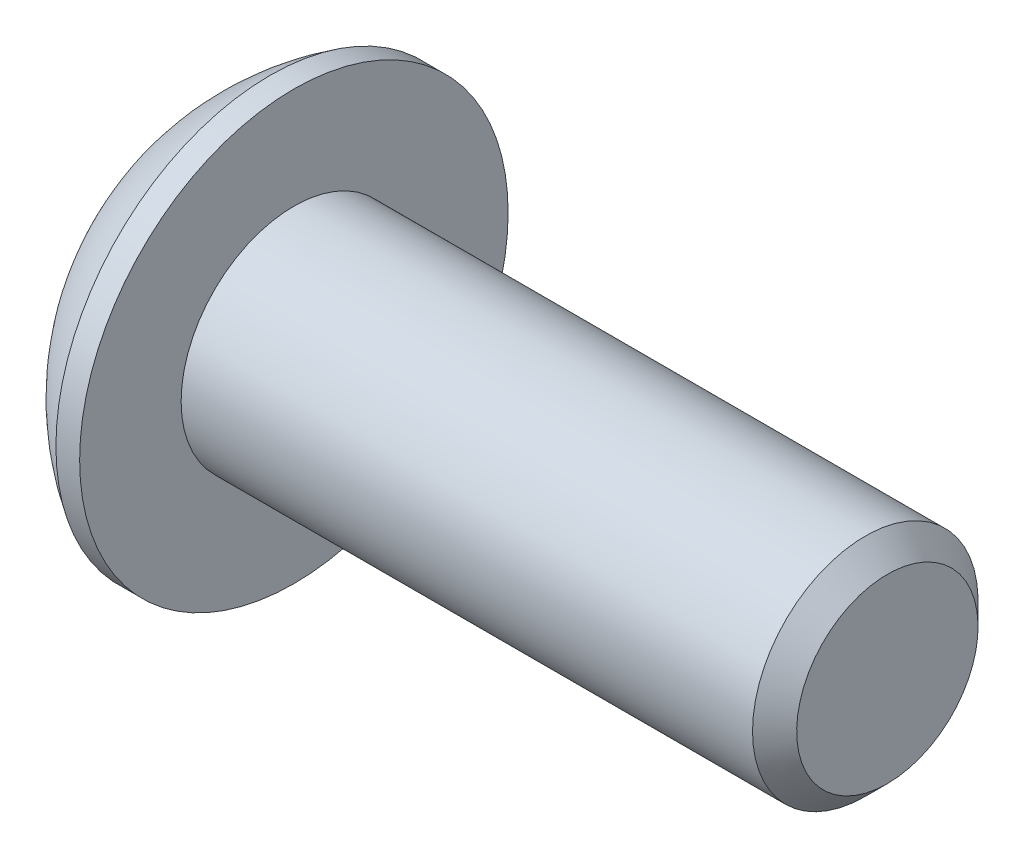
ISO-10303-21;
HEADER;
FILE_DESCRIPTION(('STEP AP214'),'2;1');
FILE_NAME('part.step','',(''),(''),'','','');
FILE_SCHEMA(('AUTOMOTIVE_DESIGN { 1 0 10303 214 1 1 1 1 }'));
ENDSEC;
DATA;
#1=APPLICATION_CONTEXT('core data for automotive mechanical design processes');
#2=APPLICATION_PROTOCOL_DEFINITION('international standard','automotive_design',2000,#1);
#3=PRODUCT_CONTEXT('',#1,'mechanical');
#4=PRODUCT('Part','Part','',(#3));
#5=PRODUCT_RELATED_PRODUCT_CATEGORY('part','',(#4));
#6=PRODUCT_DEFINITION_FORMATION('','',#4);
#7=PRODUCT_DEFINITION_CONTEXT('part definition',#1,'design');
#8=PRODUCT_DEFINITION('design','',#6,#7);
#9=PRODUCT_DEFINITION_SHAPE('','',#8);
#10=(LENGTH_UNIT() NAMED_UNIT(*) SI_UNIT(.MILLI.,.METRE.));
#11=(NAMED_UNIT(*) PLANE_ANGLE_UNIT() SI_UNIT($,.RADIAN.));
#12=(NAMED_UNIT(*) SI_UNIT($,.STERADIAN.) SOLID_ANGLE_UNIT());
#13=UNCERTAINTY_MEASURE_WITH_UNIT(LENGTH_MEASURE(1.E-05),#10,'distance_accuracy_value','');
#14=(GEOMETRIC_REPRESENTATION_CONTEXT(3) GLOBAL_UNCERTAINTY_ASSIGNED_CONTEXT((#13)) GLOBAL_UNIT_ASSIGNED_CONTEXT((#10,
#11,#12)) REPRESENTATION_CONTEXT('',''));
#15=CARTESIAN_POINT('',(0.,0.,0.));
#16=DIRECTION('',(0.,0.,1.));
#17=DIRECTION('',(1.,0.,0.));
#18=AXIS2_PLACEMENT_3D('',#15,#16,#17);
#19=CARTESIAN_POINT('',(1.7779999943448,0.,0.));
#20=DIRECTION('',(-1.,0.,0.));
#21=DIRECTION('',(0.,-1.,0.));
#22=AXIS2_PLACEMENT_3D('',#19,#20,#21);
#23=CONICAL_SURFACE('',#22,1.58749999673491,1.04719755119988);
#24=CARTESIAN_POINT('',(2.69454354479104,0.,-4.44089209850063E-13));
#25=VERTEX_POINT('',#24);
#26=VERTEX_LOOP('',#25);
#27=FACE_BOUND('',#26,.T.);
#28=CARTESIAN_POINT('',(1.77799999434485,0.,0.));
#29=DIRECTION('',(-1.,0.,0.));
#30=DIRECTION('',(0.,-1.,0.));
#31=AXIS2_PLACEMENT_3D('',#28,#29,#30);
#32=CIRCLE('',#31,1.58749999673491);
#33=CARTESIAN_POINT('',(1.77799999717317,0.,1.58749999836612));
#34=VERTEX_POINT('',#33);
#35=CARTESIAN_POINT('',(1.77799999717243,-1.3748153270964,0.793749999181859));
#36=VERTEX_POINT('',#35);
#37=EDGE_CURVE('E20',#34,#36,#32,.F.);
#38=ORIENTED_EDGE('',*,*,#37,.F.);
#39=CARTESIAN_POINT('',(1.77799999434634,0.,0.));
#40=DIRECTION('',(-1.,0.,0.));
#41=DIRECTION('',(0.,-1.,0.));
#42=AXIS2_PLACEMENT_3D('',#39,#40,#41);
#43=CIRCLE('',#42,1.58749999673224);
#44=CARTESIAN_POINT('',(1.77799999717317,1.37481532724848,0.793749998914057));
#45=VERTEX_POINT('',#44);
#46=EDGE_CURVE('E153',#34,#45,#43,.T.);
#47=ORIENTED_EDGE('',*,*,#46,.T.);
#48=CARTESIAN_POINT('',(1.77799999434532,0.,0.));
#49=DIRECTION('',(-1.,0.,0.));
#50=DIRECTION('',(0.,-1.,0.));
#51=AXIS2_PLACEMENT_3D('',#48,#49,#50);
#52=CIRCLE('',#51,1.58749999673402);
#53=CARTESIAN_POINT('',(1.77799999717266,1.37481532693781,-0.793749999455669));
#54=VERTEX_POINT('',#53);
#55=EDGE_CURVE('E462',#45,#54,#52,.T.);
#56=ORIENTED_EDGE('',*,*,#55,.T.);
#57=CARTESIAN_POINT('',(1.7779999943448,0.,0.));
#58=DIRECTION('',(-1.,0.,0.));
#59=DIRECTION('',(0.,-1.,0.));
#60=AXIS2_PLACEMENT_3D('',#57,#58,#59);
#61=CIRCLE('',#60,1.58749999673491);
#62=CARTESIAN_POINT('',(1.7779999971724,0.,-1.58749999836745));
#63=VERTEX_POINT('',#62);
#64=EDGE_CURVE('E463',#54,#63,#61,.T.);
#65=ORIENTED_EDGE('',*,*,#64,.T.);
#66=CARTESIAN_POINT('',(1.77799999434447,0.,0.));
#67=DIRECTION('',(-1.,0.,0.));
#68=DIRECTION('',(0.,-1.,0.));
#69=AXIS2_PLACEMENT_3D('',#66,#67,#68);
#70=CIRCLE('',#69,1.58749999673558);
#71=CARTESIAN_POINT('',(1.77799999717224,-1.37481532709594,-0.793749999181592));
#72=VERTEX_POINT('',#71);
#73=EDGE_CURVE('E466',#72,#63,#70,.F.);
#74=ORIENTED_EDGE('',*,*,#73,.F.);
#75=CARTESIAN_POINT('',(1.77799999434447,0.,0.));
#76=DIRECTION('',(-1.,0.,0.));
#77=DIRECTION('',(0.,-1.,0.));
#78=AXIS2_PLACEMENT_3D('',#75,#76,#77);
#79=CIRCLE('',#78,1.58749999673558);
#80=EDGE_CURVE('E469',#36,#72,#79,.F.);
#81=ORIENTED_EDGE('',*,*,#80,.F.);
#82=EDGE_LOOP('',(#38,#47,#56,#65,#74,#81));
#83=FACE_BOUND('',#82,.T.);
#84=ADVANCED_FACE('F17',(#27,#83),#23,.F.);
#85=CARTESIAN_POINT('',(1.778,-2.74963065702,-1.5875));
#86=DIRECTION('',(1.,0.,0.));
#87=DIRECTION('',(0.,0.,-1.));
#88=AXIS2_PLACEMENT_3D('',#85,#86,#87);
#89=PLANE('',#88);
#90=DIRECTION('',(0.,0.50000000000019,0.866025403784329));
#91=VECTOR('',#90,1.);
#92=CARTESIAN_POINT('',(1.778,-1.83308710468,0.));
#93=LINE('',#92,#91);
#94=CARTESIAN_POINT('',(1.778,-0.916543552272443,1.58750000009422));
#95=VERTEX_POINT('',#94);
#96=EDGE_CURVE('E198',#95,#36,#93,.F.);
#97=ORIENTED_EDGE('',*,*,#96,.F.);
#98=DIRECTION('',(0.,1.,0.));
#99=VECTOR('',#98,1.);
#100=CARTESIAN_POINT('',(1.778,-0.916543552339,1.5875));
#101=LINE('',#100,#99);
#102=EDGE_CURVE('E152',#34,#95,#101,.F.);
#103=ORIENTED_EDGE('',*,*,#102,.F.);
#104=ORIENTED_EDGE('',*,*,#37,.T.);
#105=EDGE_LOOP('',(#97,#103,#104));
#106=FACE_BOUND('',#105,.T.);
#107=ADVANCED_FACE('F277',(#106),#89,.F.);
#108=CARTESIAN_POINT('',(1.778,-2.74963065702,-1.5875));
#109=DIRECTION('',(1.,0.,0.));
#110=DIRECTION('',(0.,0.,-1.));
#111=AXIS2_PLACEMENT_3D('',#108,#109,#110);
#112=PLANE('',#111);
#113=DIRECTION('',(0.,-0.50000000000019,0.866025403784329));
#114=VECTOR('',#113,1.);
#115=CARTESIAN_POINT('',(1.778,-0.916543552339,-1.5875));
#116=LINE('',#115,#114);
#117=CARTESIAN_POINT('',(1.778,-1.83308710474991,1.46216049701282E-10));
#118=VERTEX_POINT('',#117);
#119=EDGE_CURVE('E183',#118,#72,#116,.F.);
#120=ORIENTED_EDGE('',*,*,#119,.F.);
#121=DIRECTION('',(0.,0.50000000000019,0.866025403784329));
#122=VECTOR('',#121,1.);
#123=CARTESIAN_POINT('',(1.778,-1.83308710468,0.));
#124=LINE('',#123,#122);
#125=EDGE_CURVE('E195',#36,#118,#124,.F.);
#126=ORIENTED_EDGE('',*,*,#125,.F.);
#127=ORIENTED_EDGE('',*,*,#80,.T.);
#128=EDGE_LOOP('',(#120,#126,#127));
#129=FACE_BOUND('',#128,.T.);
#130=ADVANCED_FACE('F274',(#129),#112,.F.);
#131=CARTESIAN_POINT('',(1.778,-2.74963065702,-1.5875));
#132=DIRECTION('',(1.,0.,0.));
#133=DIRECTION('',(0.,0.,-1.));
#134=AXIS2_PLACEMENT_3D('',#131,#132,#133);
#135=PLANE('',#134);
#136=DIRECTION('',(0.,1.,0.));
#137=VECTOR('',#136,1.);
#138=CARTESIAN_POINT('',(1.778,0.916543552339,-1.5875));
#139=LINE('',#138,#137);
#140=CARTESIAN_POINT('',(1.778,-0.916543552502021,-1.58749999998871));
#141=VERTEX_POINT('',#140);
#142=EDGE_CURVE('E169',#141,#63,#139,.T.);
#143=ORIENTED_EDGE('',*,*,#142,.F.);
#144=DIRECTION('',(0.,-0.50000000000019,0.866025403784329));
#145=VECTOR('',#144,1.);
#146=CARTESIAN_POINT('',(1.778,-0.916543552339,-1.5875));
#147=LINE('',#146,#145);
#148=EDGE_CURVE('E180',#72,#141,#147,.F.);
#149=ORIENTED_EDGE('',*,*,#148,.F.);
#150=ORIENTED_EDGE('',*,*,#73,.T.);
#151=EDGE_LOOP('',(#143,#149,#150));
#152=FACE_BOUND('',#151,.T.);
#153=ADVANCED_FACE('F270',(#152),#135,.F.);
#154=CARTESIAN_POINT('',(1.778,-2.74963065702,-1.5875));
#155=DIRECTION('',(1.,0.,0.));
#156=DIRECTION('',(0.,0.,-1.));
#157=AXIS2_PLACEMENT_3D('',#154,#155,#156);
#158=PLANE('',#157);
#159=DIRECTION('',(0.,-0.50000000000019,-0.866025403784329));
#160=VECTOR('',#159,1.);
#161=CARTESIAN_POINT('',(1.778,1.83308710468,0.));
#162=LINE('',#161,#160);
#163=CARTESIAN_POINT('',(1.778,0.91654355229244,-1.58750000007156));
#164=VERTEX_POINT('',#163);
#165=EDGE_CURVE('E157',#164,#54,#162,.F.);
#166=ORIENTED_EDGE('',*,*,#165,.F.);
#167=DIRECTION('',(0.,1.,0.));
#168=VECTOR('',#167,1.);
#169=CARTESIAN_POINT('',(1.778,0.916543552339,-1.5875));
#170=LINE('',#169,#168);
#171=EDGE_CURVE('E166',#63,#164,#170,.T.);
#172=ORIENTED_EDGE('',*,*,#171,.F.);
#173=ORIENTED_EDGE('',*,*,#64,.F.);
#174=EDGE_LOOP('',(#166,#172,#173));
#175=FACE_BOUND('',#174,.T.);
#176=ADVANCED_FACE('F266',(#175),#158,.F.);
#177=CARTESIAN_POINT('',(1.778,-2.74963065702,-1.5875));
#178=DIRECTION('',(1.,0.,0.));
#179=DIRECTION('',(0.,0.,-1.));
#180=AXIS2_PLACEMENT_3D('',#177,#178,#179);
#181=PLANE('',#180);
#182=DIRECTION('',(0.,0.50000000000019,-0.866025403784329));
#183=VECTOR('',#182,1.);
#184=CARTESIAN_POINT('',(1.778,0.916543552339,1.5875));
#185=LINE('',#184,#183);
#186=CARTESIAN_POINT('',(1.778,1.83308710474991,-1.46215994686138E-10));
#187=VERTEX_POINT('',#186);
#188=EDGE_CURVE('E137',#187,#45,#185,.F.);
#189=ORIENTED_EDGE('',*,*,#188,.F.);
#190=DIRECTION('',(0.,-0.50000000000019,-0.866025403784329));
#191=VECTOR('',#190,1.);
#192=CARTESIAN_POINT('',(1.778,1.83308710468,0.));
#193=LINE('',#192,#191);
#194=EDGE_CURVE('E108',#54,#187,#193,.F.);
#195=ORIENTED_EDGE('',*,*,#194,.F.);
#196=ORIENTED_EDGE('',*,*,#55,.F.);
#197=EDGE_LOOP('',(#189,#195,#196));
#198=FACE_BOUND('',#197,.T.);
#199=ADVANCED_FACE('F262',(#198),#181,.F.);
#200=CARTESIAN_POINT('',(1.778,-2.74963065702,-1.5875));
#201=DIRECTION('',(1.,0.,0.));
#202=DIRECTION('',(0.,0.,-1.));
#203=AXIS2_PLACEMENT_3D('',#200,#201,#202);
#204=PLANE('',#203);
#205=DIRECTION('',(0.,1.,0.));
#206=VECTOR('',#205,1.);
#207=CARTESIAN_POINT('',(1.778,-0.916543552339,1.5875));
#208=LINE('',#207,#206);
#209=CARTESIAN_POINT('',(1.778,0.916543552358563,1.58749999997741));
#210=VERTEX_POINT('',#209);
#211=EDGE_CURVE('E149',#210,#34,#208,.F.);
#212=ORIENTED_EDGE('',*,*,#211,.F.);
#213=DIRECTION('',(0.,0.50000000000019,-0.866025403784329));
#214=VECTOR('',#213,1.);
#215=CARTESIAN_POINT('',(1.778,0.916543552339,1.5875));
#216=LINE('',#215,#214);
#217=EDGE_CURVE('E139',#45,#210,#216,.F.);
#218=ORIENTED_EDGE('',*,*,#217,.F.);
#219=ORIENTED_EDGE('',*,*,#46,.F.);
#220=EDGE_LOOP('',(#212,#218,#219));
#221=FACE_BOUND('',#220,.T.);
#222=ADVANCED_FACE('F258',(#221),#204,.F.);
#223=CARTESIAN_POINT('',(1.778,-0.916543552339,1.5875));
#224=DIRECTION('',(0.,0.,-1.));
#225=DIRECTION('',(0.,1.,0.));
#226=AXIS2_PLACEMENT_3D('',#223,#224,#225);
#227=PLANE('',#226);
#228=DIRECTION('',(0.,1.,0.));
#229=VECTOR('',#228,1.);
#230=CARTESIAN_POINT('',(0.,0.,1.58750000037));
#231=LINE('',#230,#229);
#232=CARTESIAN_POINT('',(0.,0.91654355257375,1.5875000000925));
#233=VERTEX_POINT('',#232);
#234=CARTESIAN_POINT('',(0.,-0.916543552240135,1.58750000012821));
#235=VERTEX_POINT('',#234);
#236=EDGE_CURVE('E111',#233,#235,#231,.F.);
#237=ORIENTED_EDGE('',*,*,#236,.F.);
#238=DIRECTION('',(1.,0.,0.));
#239=VECTOR('',#238,1.);
#240=CARTESIAN_POINT('',(1.778,0.916543552339,1.5875));
#241=LINE('',#240,#239);
#242=EDGE_CURVE('E112',#210,#233,#241,.F.);
#243=ORIENTED_EDGE('',*,*,#242,.F.);
#244=ORIENTED_EDGE('',*,*,#211,.T.);
#245=ORIENTED_EDGE('',*,*,#102,.T.);
#246=DIRECTION('',(1.,0.,0.));
#247=VECTOR('',#246,1.);
#248=CARTESIAN_POINT('',(1.778,-0.916543552258539,1.58750000014284));
#249=LINE('',#248,#247);
#250=EDGE_CURVE('E192',#235,#95,#249,.T.);
#251=ORIENTED_EDGE('',*,*,#250,.F.);
#252=EDGE_LOOP('',(#237,#243,#244,#245,#251));
#253=FACE_BOUND('',#252,.T.);
#254=ADVANCED_FACE('F254',(#253),#227,.T.);
#255=CARTESIAN_POINT('',(1.778,-1.83308710468,0.));
#256=DIRECTION('',(0.,0.866025403784329,-0.50000000000019));
#257=DIRECTION('',(0.,0.50000000000019,0.866025403784329));
#258=AXIS2_PLACEMENT_3D('',#255,#256,#257);
#259=PLANE('',#258);
#260=DIRECTION('',(0.,-0.500000000039216,-0.866025403761797));
#261=VECTOR('',#260,1.);
#262=CARTESIAN_POINT('',(0.,-0.916543552652,1.58750000037));
#263=LINE('',#262,#261);
#264=CARTESIAN_POINT('',(0.,-1.83308710487337,6.73339472019125E-11));
#265=VERTEX_POINT('',#264);
#266=EDGE_CURVE('E133',#235,#265,#263,.T.);
#267=ORIENTED_EDGE('',*,*,#266,.F.);
#268=ORIENTED_EDGE('',*,*,#250,.T.);
#269=ORIENTED_EDGE('',*,*,#96,.T.);
#270=ORIENTED_EDGE('',*,*,#125,.T.);
#271=DIRECTION('',(1.,0.,0.));
#272=VECTOR('',#271,1.);
#273=CARTESIAN_POINT('',(1.778,-1.8330871048335,2.69336202646242E-10));
#274=LINE('',#273,#272);
#275=EDGE_CURVE('E177',#265,#118,#274,.T.);
#276=ORIENTED_EDGE('',*,*,#275,.F.);
#277=EDGE_LOOP('',(#267,#268,#269,#270,#276));
#278=FACE_BOUND('',#277,.T.);
#279=ADVANCED_FACE('F250',(#278),#259,.T.);
#280=CARTESIAN_POINT('',(1.778,-0.916543552339,-1.5875));
#281=DIRECTION('',(0.,0.866025403784329,0.50000000000019));
#282=DIRECTION('',(0.,-0.50000000000019,0.866025403784329));
#283=AXIS2_PLACEMENT_3D('',#280,#281,#282);
#284=PLANE('',#283);
#285=DIRECTION('',(0.,0.500000000039216,-0.866025403761797));
#286=VECTOR('',#285,1.);
#287=CARTESIAN_POINT('',(0.,-1.8330871053,0.));
#288=LINE('',#287,#286);
#289=CARTESIAN_POINT('',(0.,-0.9165435524955,-1.5875000000925));
#290=VERTEX_POINT('',#289);
#291=EDGE_CURVE('E128',#265,#290,#288,.T.);
#292=ORIENTED_EDGE('',*,*,#291,.F.);
#293=ORIENTED_EDGE('',*,*,#275,.T.);
#294=ORIENTED_EDGE('',*,*,#119,.T.);
#295=ORIENTED_EDGE('',*,*,#148,.T.);
#296=DIRECTION('',(1.,0.,0.));
#297=VECTOR('',#296,1.);
#298=CARTESIAN_POINT('',(1.778,-0.916543552652,-1.5875));
#299=LINE('',#298,#297);
#300=EDGE_CURVE('E163',#290,#141,#299,.T.);
#301=ORIENTED_EDGE('',*,*,#300,.F.);
#302=EDGE_LOOP('',(#292,#293,#294,#295,#301));
#303=FACE_BOUND('',#302,.T.);
#304=ADVANCED_FACE('F246',(#303),#284,.T.);
#305=CARTESIAN_POINT('',(1.778,0.916543552339,-1.5875));
#306=DIRECTION('',(0.,0.,1.));
#307=DIRECTION('',(1.,0.,0.));
#308=AXIS2_PLACEMENT_3D('',#305,#306,#307);
#309=PLANE('',#308);
#310=DIRECTION('',(0.,1.,0.));
#311=VECTOR('',#310,1.);
#312=CARTESIAN_POINT('',(0.,0.,-1.58750000037));
#313=LINE('',#312,#311);
#314=CARTESIAN_POINT('',(0.,0.916543552397135,-1.58750000012821));
#315=VERTEX_POINT('',#314);
#316=EDGE_CURVE('E126',#290,#315,#313,.T.);
#317=ORIENTED_EDGE('',*,*,#316,.F.);
#318=ORIENTED_EDGE('',*,*,#300,.T.);
#319=ORIENTED_EDGE('',*,*,#142,.T.);
#320=ORIENTED_EDGE('',*,*,#171,.T.);
#321=DIRECTION('',(1.,0.,0.));
#322=VECTOR('',#321,1.);
#323=CARTESIAN_POINT('',(1.778,0.916543552258539,-1.58750000014284));
#324=LINE('',#323,#322);
#325=EDGE_CURVE('E140',#315,#164,#324,.T.);
#326=ORIENTED_EDGE('',*,*,#325,.F.);
#327=EDGE_LOOP('',(#317,#318,#319,#320,#326));
#328=FACE_BOUND('',#327,.T.);
#329=ADVANCED_FACE('F243',(#328),#309,.T.);
#330=CARTESIAN_POINT('',(1.778,1.83308710468,0.));
#331=DIRECTION('',(0.,-0.866025403784329,0.50000000000019));
#332=DIRECTION('',(0.,-0.50000000000019,-0.866025403784329));
#333=AXIS2_PLACEMENT_3D('',#330,#331,#332);
#334=PLANE('',#333);
#335=DIRECTION('',(0.,0.500000000039216,0.866025403761797));
#336=VECTOR('',#335,1.);
#337=CARTESIAN_POINT('',(0.,0.916543552652,-1.58750000037));
#338=LINE('',#337,#336);
#339=CARTESIAN_POINT('',(0.,1.83308710487337,-6.73339472019125E-11));
#340=VERTEX_POINT('',#339);
#341=EDGE_CURVE('E104',#315,#340,#338,.T.);
#342=ORIENTED_EDGE('',*,*,#341,.F.);
#343=ORIENTED_EDGE('',*,*,#325,.T.);
#344=ORIENTED_EDGE('',*,*,#165,.T.);
#345=ORIENTED_EDGE('',*,*,#194,.T.);
#346=DIRECTION('',(1.,0.,0.));
#347=VECTOR('',#346,1.);
#348=CARTESIAN_POINT('',(1.778,1.8330871048335,-2.69336202646242E-10));
#349=LINE('',#348,#347);
#350=EDGE_CURVE('E99',#340,#187,#349,.T.);
#351=ORIENTED_EDGE('',*,*,#350,.F.);
#352=EDGE_LOOP('',(#342,#343,#344,#345,#351));
#353=FACE_BOUND('',#352,.T.);
#354=ADVANCED_FACE('F101',(#353),#334,.T.);
#355=CARTESIAN_POINT('',(1.778,0.916543552339,1.5875));
#356=DIRECTION('',(0.,-0.866025403784329,-0.50000000000019));
#357=DIRECTION('',(0.,0.50000000000019,-0.866025403784329));
#358=AXIS2_PLACEMENT_3D('',#355,#356,#357);
#359=PLANE('',#358);
#360=DIRECTION('',(0.,-0.500000000039216,0.866025403761797));
#361=VECTOR('',#360,1.);
#362=CARTESIAN_POINT('',(0.,1.8330871053,0.));
#363=LINE('',#362,#361);
#364=EDGE_CURVE('E116',#340,#233,#363,.T.);
#365=ORIENTED_EDGE('',*,*,#364,.F.);
#366=ORIENTED_EDGE('',*,*,#350,.T.);
#367=ORIENTED_EDGE('',*,*,#188,.T.);
#368=ORIENTED_EDGE('',*,*,#217,.T.);
#369=ORIENTED_EDGE('',*,*,#242,.T.);
#370=EDGE_LOOP('',(#365,#366,#367,#368,#369));
#371=FACE_BOUND('',#370,.T.);
#372=ADVANCED_FACE('F117',(#371),#359,.T.);
#373=CARTESIAN_POINT('',(0.,0.,0.));
#374=DIRECTION('',(-1.,0.,0.));
#375=DIRECTION('',(0.,0.,1.));
#376=AXIS2_PLACEMENT_3D('',#373,#374,#375);
#377=PLANE('',#376);
#378=ORIENTED_EDGE('',*,*,#341,.T.);
#379=ORIENTED_EDGE('',*,*,#364,.T.);
#380=ORIENTED_EDGE('',*,*,#236,.T.);
#381=ORIENTED_EDGE('',*,*,#266,.T.);
#382=ORIENTED_EDGE('',*,*,#291,.T.);
#383=ORIENTED_EDGE('',*,*,#316,.T.);
#384=EDGE_LOOP('',(#378,#379,#380,#381,#382,#383));
#385=FACE_BOUND('',#384,.T.);
#386=CARTESIAN_POINT('',(0.,0.,2.29235000000582));
#387=CARTESIAN_POINT('',(0.,-0.0644927655126321,2.29234957048666));
#388=CARTESIAN_POINT('',(0.,-0.128954632490416,2.28962664242158));
#389=CARTESIAN_POINT('',(0.,-0.257417121211139,2.27876377052461));
#390=CARTESIAN_POINT('',(0.,-0.321417764883581,2.27062408598067));
#391=CARTESIAN_POINT('',(0.,-0.511935928844583,2.23815591485029));
#392=CARTESIAN_POINT('',(0.,-0.637177211843635,2.20577810511166));
#393=CARTESIAN_POINT('',(0.,-0.880442840436124,2.12045622664339));
#394=CARTESIAN_POINT('',(0.,-0.998463671941219,2.0675022345102));
#395=CARTESIAN_POINT('',(0.,-1.22392887592909,1.94254083996535));
#396=CARTESIAN_POINT('',(0.,-1.33137578811149,1.87053802819877));
#397=CARTESIAN_POINT('',(0.,-1.53264624312449,1.70952508495421));
#398=CARTESIAN_POINT('',(0.,-1.62647074736679,1.62051615472371));
#399=CARTESIAN_POINT('',(0.,-1.79788239104393,1.42797194155412));
#400=CARTESIAN_POINT('',(0.,-1.8754633128177,1.32443112138749));
#401=CARTESIAN_POINT('',(0.,-2.01216281513216,1.10576170793454));
#402=CARTESIAN_POINT('',(0.,-2.07127415798524,0.990628595277835));
#403=CARTESIAN_POINT('',(0.,-2.16926281139454,0.752162374135416));
#404=CARTESIAN_POINT('',(0.,-2.20816359912689,0.628838968482848));
#405=CARTESIAN_POINT('',(0.,-2.25500659855317,0.420694862046618));
#406=CARTESIAN_POINT('',(0.,-2.26899165824573,0.337184123653263));
#407=CARTESIAN_POINT('',(0.,-2.28766525785621,0.169127874081541));
#408=CARTESIAN_POINT('',(0.,-2.29235360241283,0.0845823411955508));
#409=CARTESIAN_POINT('',(0.,-2.2923445154299,-0.128774531245247));
#410=CARTESIAN_POINT('',(-2.69307603749814E-13,-2.28146342034665,-0.257634381621617));
#411=CARTESIAN_POINT('',(2.70468192056077E-13,-2.23821068773009,-0.51179404434701));
#412=CARTESIAN_POINT('',(1.02208657068993E-12,-2.20581570141796,-0.637089834424596));
#413=CARTESIAN_POINT('',(9.0672084742204E-13,-2.12045794877005,-0.880418123737252));
#414=CARTESIAN_POINT('',(0.,-2.06750420988529,-0.99845378461484));
#415=CARTESIAN_POINT('',(0.,-1.94254288081218,-1.22393151507484));
#416=CARTESIAN_POINT('',(7.46341197952349E-13,-1.87053927054731,-1.33137579099465));
#417=CARTESIAN_POINT('',(8.84953972337806E-13,-1.70951283543301,-1.53265999940217));
#418=CARTESIAN_POINT('',(2.37559978039241E-13,-1.62048888578876,-1.62649903206177));
#419=CARTESIAN_POINT('',(-2.36710775134398E-13,-1.42794019104736,-1.79790664679249));
#420=CARTESIAN_POINT('',(0.,-1.32441433601962,-1.87547398234271));
#421=CARTESIAN_POINT('',(0.,-1.1057972620205,-2.01214041244863));
#422=CARTESIAN_POINT('',(0.,-0.990703506929408,-2.07123544545653));
#423=CARTESIAN_POINT('',(0.,-0.752242724163928,-2.16923770575658));
#424=CARTESIAN_POINT('',(0.,-0.628879995268125,-2.20815533212482));
#425=CARTESIAN_POINT('',(0.,-0.420632245766307,-2.25502005554719));
#426=CARTESIAN_POINT('',(0.,-0.337057296243909,-2.2690109072416));
#427=CARTESIAN_POINT('',(0.,-0.168999858642254,-2.28767431726305));
#428=CARTESIAN_POINT('',(0.,-0.0845189102378446,-2.29236074400464));
#429=CARTESIAN_POINT('',(0.,0.,-2.29235000000582));
#430=B_SPLINE_CURVE_WITH_KNOTS('',3,(#386,#387,#388,#389,#390,#391,#392,#393,#394,#395,#396,
#397,#398,#399,#400,#401,#402,#403,#404,#405,#406,#407,#408,#409,#410,#411,#412,#413,#414,#415,
#416,#417,#418,#419,#420,#421,#422,#423,#424,#425,#426,#427,#428,#429),.UNSPECIFIED.,.F.,.F.,(4,
2,2,2,2,2,2,2,2,2,2,2,2,2,2,2,2,2,2,2,2,4),(0.,0.19335945732349,0.386709659629922,
0.772795399141744,1.15906757019445,1.54524673676071,1.93139863517894,2.31769807431898,
2.70414870360051,3.09014941104142,3.34368897698696,3.59723387076034,3.98324972683374,
4.36968520760396,4.7559511941907,5.14213654523224,5.52834742628886,5.91458788288826,
6.30091320343061,6.68703922036346,6.94077068807764,7.19412367965007),.UNSPECIFIED.);
#431=CARTESIAN_POINT('',(0.,0.,2.29235000000582));
#432=VERTEX_POINT('',#431);
#433=CARTESIAN_POINT('',(0.,0.,-2.29235000000582));
#434=VERTEX_POINT('',#433);
#435=EDGE_CURVE('E34',#432,#434,#430,.T.);
#436=ORIENTED_EDGE('',*,*,#435,.F.);
#437=CARTESIAN_POINT('',(0.,0.,0.));
#438=DIRECTION('',(-1.,0.,0.));
#439=DIRECTION('',(0.,-1.,0.));
#440=AXIS2_PLACEMENT_3D('',#437,#438,#439);
#441=CIRCLE('',#440,2.29235000000582);
#442=EDGE_CURVE('E224',#434,#432,#441,.F.);
#443=ORIENTED_EDGE('',*,*,#442,.F.);
#444=EDGE_LOOP('',(#436,#443));
#445=FACE_BOUND('',#444,.T.);
#446=ADVANCED_FACE('F123',(#385,#445),#377,.T.);
#447=CARTESIAN_POINT('',(4.85989606481,0.,0.));
#448=DIRECTION('',(-1.,0.,0.));
#449=DIRECTION('',(0.,1.,0.));
#450=AXIS2_PLACEMENT_3D('',#447,#448,#449);
#451=SPHERICAL_SURFACE('',#450,5.37340285883);
#452=ORIENTED_EDGE('',*,*,#442,.T.);
#453=ORIENTED_EDGE('',*,*,#435,.T.);
#454=EDGE_LOOP('',(#452,#453));
#455=FACE_BOUND('',#454,.T.);
#456=CARTESIAN_POINT('',(2.05739999935,0.,0.));
#457=DIRECTION('',(-1.,0.,0.));
#458=DIRECTION('',(0.,0.,1.));
#459=AXIS2_PLACEMENT_3D('',#456,#457,#458);
#460=CIRCLE('',#459,4.5847);
#461=CARTESIAN_POINT('',(2.05739999935,0.,4.5847));
#462=VERTEX_POINT('',#461);
#463=EDGE_CURVE('E223',#462,#462,#460,.F.);
#464=ORIENTED_EDGE('',*,*,#463,.F.);
#465=EDGE_LOOP('',(#464));
#466=FACE_BOUND('',#465,.T.);
#467=ADVANCED_FACE('F238',(#455,#466),#451,.T.);
#468=CARTESIAN_POINT('',(15.2654,0.,0.));
#469=DIRECTION('',(-1.,0.,0.));
#470=DIRECTION('',(0.,0.,1.));
#471=AXIS2_PLACEMENT_3D('',#468,#469,#470);
#472=PLANE('',#471);
#473=CARTESIAN_POINT('',(15.2654000000325,0.,0.));
#474=DIRECTION('',(-1.,0.,0.));
#475=DIRECTION('',(0.,-1.,0.));
#476=AXIS2_PLACEMENT_3D('',#473,#474,#475);
#477=CIRCLE('',#476,1.94055999998);
#478=CARTESIAN_POINT('',(15.2654000000325,-1.94055999998,0.));
#479=VERTEX_POINT('',#478);
#480=EDGE_CURVE('E220',#479,#479,#477,.T.);
#481=ORIENTED_EDGE('',*,*,#480,.F.);
#482=EDGE_LOOP('',(#481));
#483=FACE_BOUND('',#482,.T.);
#484=ADVANCED_FACE('F304',(#483),#472,.F.);
#485=CARTESIAN_POINT('',(0.,0.,0.));
#486=DIRECTION('',(-1.,0.,0.));
#487=DIRECTION('',(0.,0.,1.));
#488=AXIS2_PLACEMENT_3D('',#485,#486,#487);
#489=CYLINDRICAL_SURFACE('',#488,4.5847);
#490=ORIENTED_EDGE('',*,*,#463,.T.);
#491=EDGE_LOOP('',(#490));
#492=FACE_BOUND('',#491,.T.);
#493=CARTESIAN_POINT('',(2.56540000066,0.,0.));
#494=DIRECTION('',(-1.,0.,0.));
#495=DIRECTION('',(0.,0.,1.));
#496=AXIS2_PLACEMENT_3D('',#493,#494,#495);
#497=CIRCLE('',#496,4.5847);
#498=CARTESIAN_POINT('',(2.56540000066,0.,4.5847));
#499=VERTEX_POINT('',#498);
#500=EDGE_CURVE('E217',#499,#499,#497,.T.);
#501=ORIENTED_EDGE('',*,*,#500,.T.);
#502=EDGE_LOOP('',(#501));
#503=FACE_BOUND('',#502,.T.);
#504=ADVANCED_FACE('F300',(#492,#503),#489,.T.);
#505=CARTESIAN_POINT('',(14.7929600000225,0.,0.));
#506=DIRECTION('',(-1.,0.,0.));
#507=DIRECTION('',(0.,-1.,0.));
#508=AXIS2_PLACEMENT_3D('',#505,#506,#507);
#509=CONICAL_SURFACE('',#508,2.41299999993316,0.785398163337289);
#510=CARTESIAN_POINT('',(14.79296,0.,0.));
#511=DIRECTION('',(-1.,0.,0.));
#512=DIRECTION('',(0.,0.,1.));
#513=AXIS2_PLACEMENT_3D('',#510,#511,#512);
#514=CIRCLE('',#513,2.413);
#515=CARTESIAN_POINT('',(14.79296,0.,2.413));
#516=VERTEX_POINT('',#515);
#517=EDGE_CURVE('E26',#516,#516,#514,.T.);
#518=ORIENTED_EDGE('',*,*,#517,.F.);
#519=EDGE_LOOP('',(#518));
#520=FACE_BOUND('',#519,.T.);
#521=ORIENTED_EDGE('',*,*,#480,.T.);
#522=EDGE_LOOP('',(#521));
#523=FACE_BOUND('',#522,.T.);
#524=ADVANCED_FACE('F293',(#520,#523),#509,.T.);
#525=CARTESIAN_POINT('',(2.5654,2.413,0.));
#526=DIRECTION('',(-1.,0.,0.));
#527=DIRECTION('',(0.,0.,1.));
#528=AXIS2_PLACEMENT_3D('',#525,#526,#527);
#529=PLANE('',#528);
#530=CARTESIAN_POINT('',(2.56540000066,0.,0.));
#531=DIRECTION('',(-1.,0.,0.));
#532=DIRECTION('',(0.,0.,1.));
#533=AXIS2_PLACEMENT_3D('',#530,#531,#532);
#534=CIRCLE('',#533,2.413);
#535=CARTESIAN_POINT('',(2.56540000066,0.,2.413));
#536=VERTEX_POINT('',#535);
#537=EDGE_CURVE('E11',#536,#536,#534,.F.);
#538=ORIENTED_EDGE('',*,*,#537,.F.);
#539=EDGE_LOOP('',(#538));
#540=FACE_BOUND('',#539,.T.);
#541=ORIENTED_EDGE('',*,*,#500,.F.);
#542=EDGE_LOOP('',(#541));
#543=FACE_BOUND('',#542,.T.);
#544=ADVANCED_FACE('F287',(#540,#543),#529,.F.);
#545=CARTESIAN_POINT('',(0.,0.,0.));
#546=DIRECTION('',(-1.,0.,0.));
#547=DIRECTION('',(0.,0.,1.));
#548=AXIS2_PLACEMENT_3D('',#545,#546,#547);
#549=CYLINDRICAL_SURFACE('',#548,2.413);
#550=ORIENTED_EDGE('',*,*,#537,.T.);
#551=EDGE_LOOP('',(#550));
#552=FACE_BOUND('',#551,.T.);
#553=ORIENTED_EDGE('',*,*,#517,.T.);
#554=EDGE_LOOP('',(#553));
#555=FACE_BOUND('',#554,.T.);
#556=ADVANCED_FACE('F285',(#552,#555),#549,.T.);
#557=CLOSED_SHELL('',(#84,#107,#130,#153,#176,#199,#222,#254,#279,#304,#329,#354,#372,#446,#467,
#484,#504,#524,#544,#556));
#558=MANIFOLD_SOLID_BREP('B1',#557);
#559=ADVANCED_BREP_SHAPE_REPRESENTATION('',(#18,#558),#14);
#560=SHAPE_DEFINITION_REPRESENTATION(#9,#559);
ENDSEC;
END-ISO-10303-21;
